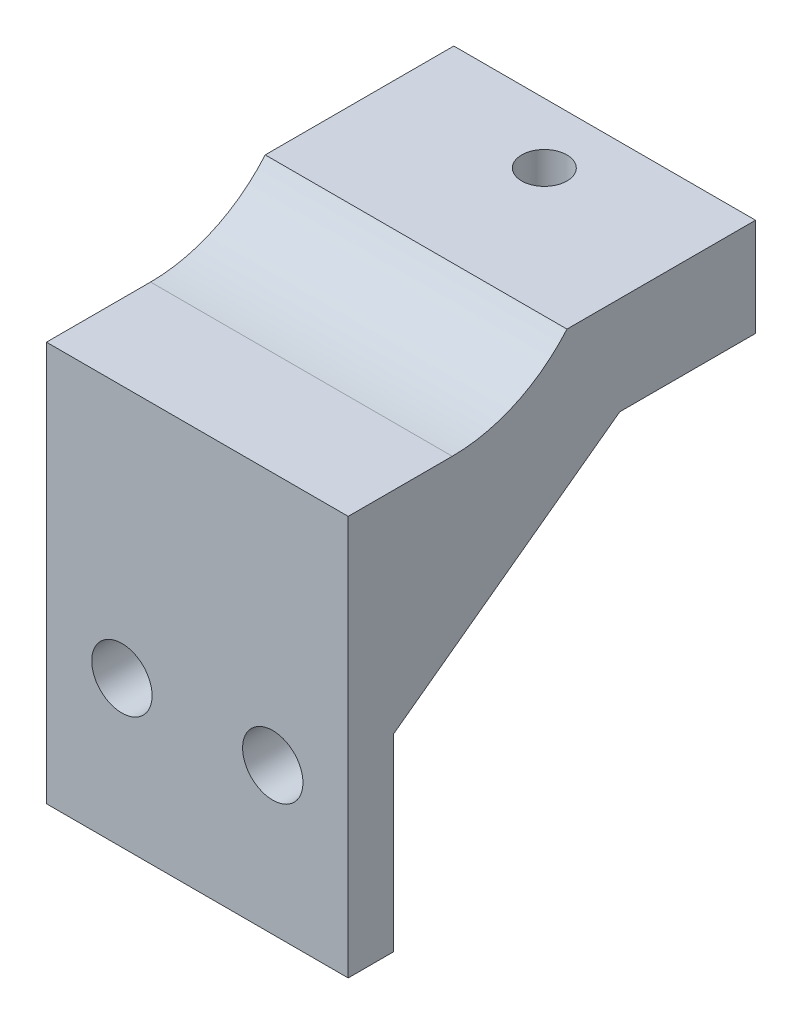
ISO-10303-21;
HEADER;
FILE_DESCRIPTION(('STEP AP214'),'2;1');
FILE_NAME('part.step','',(''),(''),'','','');
FILE_SCHEMA(('AUTOMOTIVE_DESIGN { 1 0 10303 214 1 1 1 1 }'));
ENDSEC;
DATA;
#1=APPLICATION_CONTEXT('core data for automotive mechanical design processes');
#2=APPLICATION_PROTOCOL_DEFINITION('international standard','automotive_design',2000,#1);
#3=PRODUCT_CONTEXT('',#1,'mechanical');
#4=PRODUCT('Part','Part','',(#3));
#5=PRODUCT_RELATED_PRODUCT_CATEGORY('part','',(#4));
#6=PRODUCT_DEFINITION_FORMATION('','',#4);
#7=PRODUCT_DEFINITION_CONTEXT('part definition',#1,'design');
#8=PRODUCT_DEFINITION('design','',#6,#7);
#9=PRODUCT_DEFINITION_SHAPE('','',#8);
#10=(LENGTH_UNIT() NAMED_UNIT(*) SI_UNIT(.MILLI.,.METRE.));
#11=(NAMED_UNIT(*) PLANE_ANGLE_UNIT() SI_UNIT($,.RADIAN.));
#12=(NAMED_UNIT(*) SI_UNIT($,.STERADIAN.) SOLID_ANGLE_UNIT());
#13=UNCERTAINTY_MEASURE_WITH_UNIT(LENGTH_MEASURE(1.E-05),#10,'distance_accuracy_value','');
#14=(GEOMETRIC_REPRESENTATION_CONTEXT(3) GLOBAL_UNCERTAINTY_ASSIGNED_CONTEXT((#13)) GLOBAL_UNIT_ASSIGNED_CONTEXT((#10,
#11,#12)) REPRESENTATION_CONTEXT('',''));
#15=CARTESIAN_POINT('',(0.,0.,0.));
#16=DIRECTION('',(0.,0.,1.));
#17=DIRECTION('',(1.,0.,0.));
#18=AXIS2_PLACEMENT_3D('',#15,#16,#17);
#19=CARTESIAN_POINT('',(0.,0.,0.));
#20=DIRECTION('',(0.,0.,1.));
#21=DIRECTION('',(1.,0.,0.));
#22=AXIS2_PLACEMENT_3D('',#19,#20,#21);
#23=PLANE('',#22);
#24=CARTESIAN_POINT('',(5.,-45.2915026221292,0.));
#25=DIRECTION('',(0.,0.,1.));
#26=DIRECTION('',(1.,0.,0.));
#27=AXIS2_PLACEMENT_3D('',#24,#25,#26);
#28=CIRCLE('',#27,2.);
#29=CARTESIAN_POINT('',(7.,-45.2915026221292,0.));
#30=VERTEX_POINT('',#29);
#31=EDGE_CURVE('E207',#30,#30,#28,.T.);
#32=ORIENTED_EDGE('',*,*,#31,.T.);
#33=EDGE_LOOP('',(#32));
#34=FACE_BOUND('',#33,.T.);
#35=CARTESIAN_POINT('',(15.,-45.2915026221292,0.));
#36=DIRECTION('',(0.,0.,1.));
#37=DIRECTION('',(1.,0.,0.));
#38=AXIS2_PLACEMENT_3D('',#35,#36,#37);
#39=CIRCLE('',#38,2.);
#40=CARTESIAN_POINT('',(17.,-45.2915026221292,0.));
#41=VERTEX_POINT('',#40);
#42=EDGE_CURVE('E184',#41,#41,#39,.T.);
#43=ORIENTED_EDGE('',*,*,#42,.T.);
#44=EDGE_LOOP('',(#43));
#45=FACE_BOUND('',#44,.T.);
#46=DIRECTION('',(0.,-1.,0.));
#47=VECTOR('',#46,1.);
#48=CARTESIAN_POINT('',(18.,-31.5,0.));
#49=LINE('',#48,#47);
#50=CARTESIAN_POINT('',(18.,-31.5,0.));
#51=VERTEX_POINT('',#50);
#52=CARTESIAN_POINT('',(18.,-42.5,0.));
#53=VERTEX_POINT('',#52);
#54=EDGE_CURVE('E157',#51,#53,#49,.T.);
#55=ORIENTED_EDGE('',*,*,#54,.T.);
#56=DIRECTION('',(1.,0.,0.));
#57=VECTOR('',#56,1.);
#58=CARTESIAN_POINT('',(18.,-42.5,0.));
#59=LINE('',#58,#57);
#60=CARTESIAN_POINT('',(20.,-42.5,0.));
#61=VERTEX_POINT('',#60);
#62=EDGE_CURVE('E158',#53,#61,#59,.T.);
#63=ORIENTED_EDGE('',*,*,#62,.T.);
#64=DIRECTION('',(0.,-1.,0.));
#65=VECTOR('',#64,1.);
#66=CARTESIAN_POINT('',(20.,0.,0.));
#67=LINE('',#66,#65);
#68=CARTESIAN_POINT('',(20.,-55.,0.));
#69=VERTEX_POINT('',#68);
#70=EDGE_CURVE('E191',#61,#69,#67,.T.);
#71=ORIENTED_EDGE('',*,*,#70,.T.);
#72=DIRECTION('',(1.,0.,0.));
#73=VECTOR('',#72,1.);
#74=CARTESIAN_POINT('',(0.,-55.,0.));
#75=LINE('',#74,#73);
#76=CARTESIAN_POINT('',(0.,-55.,0.));
#77=VERTEX_POINT('',#76);
#78=EDGE_CURVE('E213',#77,#69,#75,.T.);
#79=ORIENTED_EDGE('',*,*,#78,.F.);
#80=DIRECTION('',(0.,1.,0.));
#81=VECTOR('',#80,1.);
#82=CARTESIAN_POINT('',(0.,0.,0.));
#83=LINE('',#82,#81);
#84=CARTESIAN_POINT('',(0.,-42.5,0.));
#85=VERTEX_POINT('',#84);
#86=EDGE_CURVE('E210',#77,#85,#83,.T.);
#87=ORIENTED_EDGE('',*,*,#86,.T.);
#88=DIRECTION('',(-1.,0.,0.));
#89=VECTOR('',#88,1.);
#90=CARTESIAN_POINT('',(2.,-42.5,0.));
#91=LINE('',#90,#89);
#92=CARTESIAN_POINT('',(2.,-42.5,0.));
#93=VERTEX_POINT('',#92);
#94=EDGE_CURVE('E176',#93,#85,#91,.T.);
#95=ORIENTED_EDGE('',*,*,#94,.F.);
#96=DIRECTION('',(0.,-1.,0.));
#97=VECTOR('',#96,1.);
#98=CARTESIAN_POINT('',(2.,-31.5,0.));
#99=LINE('',#98,#97);
#100=CARTESIAN_POINT('',(2.,-31.5,0.));
#101=VERTEX_POINT('',#100);
#102=EDGE_CURVE('E168',#101,#93,#99,.T.);
#103=ORIENTED_EDGE('',*,*,#102,.F.);
#104=DIRECTION('',(1.,0.,0.));
#105=VECTOR('',#104,1.);
#106=CARTESIAN_POINT('',(20.,-31.5,0.));
#107=LINE('',#106,#105);
#108=EDGE_CURVE('E178',#101,#51,#107,.T.);
#109=ORIENTED_EDGE('',*,*,#108,.T.);
#110=EDGE_LOOP('',(#55,#63,#71,#79,#87,#95,#103,#109));
#111=FACE_BOUND('',#110,.T.);
#112=ADVANCED_FACE('F35',(#34,#45,#111),#23,.F.);
#113=CARTESIAN_POINT('',(20.,-31.5,-24.));
#114=DIRECTION('',(0.,-1.,0.));
#115=DIRECTION('',(0.,0.,-1.));
#116=AXIS2_PLACEMENT_3D('',#113,#114,#115);
#117=PLANE('',#116);
#118=CARTESIAN_POINT('',(10.,-31.5,-20.));
#119=DIRECTION('',(0.,-1.,0.));
#120=DIRECTION('',(0.,0.,-1.));
#121=AXIS2_PLACEMENT_3D('',#118,#119,#120);
#122=CIRCLE('',#121,1.5);
#123=CARTESIAN_POINT('',(10.,-31.5,-18.5));
#124=VERTEX_POINT('',#123);
#125=EDGE_CURVE('E230',#124,#124,#122,.T.);
#126=ORIENTED_EDGE('',*,*,#125,.F.);
#127=EDGE_LOOP('',(#126));
#128=FACE_BOUND('',#127,.T.);
#129=DIRECTION('',(1.,0.,0.));
#130=VECTOR('',#129,1.);
#131=CARTESIAN_POINT('',(18.,-31.5,-15.));
#132=LINE('',#131,#130);
#133=CARTESIAN_POINT('',(18.,-31.5,-15.));
#134=VERTEX_POINT('',#133);
#135=CARTESIAN_POINT('',(20.,-31.5,-15.));
#136=VERTEX_POINT('',#135);
#137=EDGE_CURVE('E162',#134,#136,#132,.T.);
#138=ORIENTED_EDGE('',*,*,#137,.F.);
#139=DIRECTION('',(0.,0.,1.));
#140=VECTOR('',#139,1.);
#141=CARTESIAN_POINT('',(18.,-31.5,-15.));
#142=LINE('',#141,#140);
#143=EDGE_CURVE('E148',#134,#51,#142,.T.);
#144=ORIENTED_EDGE('',*,*,#143,.T.);
#145=ORIENTED_EDGE('',*,*,#108,.F.);
#146=DIRECTION('',(0.,0.,1.));
#147=VECTOR('',#146,1.);
#148=CARTESIAN_POINT('',(2.,-31.5,-15.));
#149=LINE('',#148,#147);
#150=CARTESIAN_POINT('',(2.,-31.5,-15.));
#151=VERTEX_POINT('',#150);
#152=EDGE_CURVE('E166',#151,#101,#149,.T.);
#153=ORIENTED_EDGE('',*,*,#152,.F.);
#154=DIRECTION('',(-1.,0.,0.));
#155=VECTOR('',#154,1.);
#156=CARTESIAN_POINT('',(2.,-31.5,-15.));
#157=LINE('',#156,#155);
#158=CARTESIAN_POINT('',(0.,-31.5,-15.));
#159=VERTEX_POINT('',#158);
#160=EDGE_CURVE('E172',#151,#159,#157,.T.);
#161=ORIENTED_EDGE('',*,*,#160,.T.);
#162=DIRECTION('',(0.,0.,1.));
#163=VECTOR('',#162,1.);
#164=CARTESIAN_POINT('',(0.,-31.5,-24.));
#165=LINE('',#164,#163);
#166=CARTESIAN_POINT('',(0.,-31.5,-24.));
#167=VERTEX_POINT('',#166);
#168=EDGE_CURVE('E131',#167,#159,#165,.T.);
#169=ORIENTED_EDGE('',*,*,#168,.F.);
#170=DIRECTION('',(1.,0.,0.));
#171=VECTOR('',#170,1.);
#172=CARTESIAN_POINT('',(20.,-31.5,-24.));
#173=LINE('',#172,#171);
#174=CARTESIAN_POINT('',(20.,-31.5,-24.));
#175=VERTEX_POINT('',#174);
#176=EDGE_CURVE('E132',#167,#175,#173,.T.);
#177=ORIENTED_EDGE('',*,*,#176,.T.);
#178=DIRECTION('',(0.,0.,1.));
#179=VECTOR('',#178,1.);
#180=CARTESIAN_POINT('',(20.,-31.5,-24.));
#181=LINE('',#180,#179);
#182=EDGE_CURVE('E126',#175,#136,#181,.T.);
#183=ORIENTED_EDGE('',*,*,#182,.T.);
#184=EDGE_LOOP('',(#138,#144,#145,#153,#161,#169,#177,#183));
#185=FACE_BOUND('',#184,.T.);
#186=ADVANCED_FACE('F256',(#128,#185),#117,.T.);
#187=CARTESIAN_POINT('',(0.,0.,3.));
#188=DIRECTION('',(-1.,0.,0.));
#189=DIRECTION('',(0.,0.,1.));
#190=AXIS2_PLACEMENT_3D('',#187,#188,#189);
#191=PLANE('',#190);
#192=DIRECTION('',(0.,0.591363663627517,-0.806404995855706));
#193=VECTOR('',#192,1.);
#194=CARTESIAN_POINT('',(0.,-42.5,0.));
#195=LINE('',#194,#193);
#196=EDGE_CURVE('E165',#85,#159,#195,.T.);
#197=ORIENTED_EDGE('',*,*,#196,.F.);
#198=ORIENTED_EDGE('',*,*,#86,.F.);
#199=DIRECTION('',(0.,0.,-1.));
#200=VECTOR('',#199,1.);
#201=CARTESIAN_POINT('',(0.,-55.,3.));
#202=LINE('',#201,#200);
#203=CARTESIAN_POINT('',(0.,-55.,3.));
#204=VERTEX_POINT('',#203);
#205=EDGE_CURVE('E224',#204,#77,#202,.T.);
#206=ORIENTED_EDGE('',*,*,#205,.F.);
#207=DIRECTION('',(0.,1.,0.));
#208=VECTOR('',#207,1.);
#209=CARTESIAN_POINT('',(0.,0.,3.));
#210=LINE('',#209,#208);
#211=CARTESIAN_POINT('',(0.,-28.5,3.));
#212=VERTEX_POINT('',#211);
#213=EDGE_CURVE('E194',#204,#212,#210,.T.);
#214=ORIENTED_EDGE('',*,*,#213,.T.);
#215=DIRECTION('',(0.,0.,-1.));
#216=VECTOR('',#215,1.);
#217=CARTESIAN_POINT('',(0.,-28.5,3.));
#218=LINE('',#217,#216);
#219=CARTESIAN_POINT('',(0.,-28.5,-3.90065792321466));
#220=VERTEX_POINT('',#219);
#221=EDGE_CURVE('E204',#212,#220,#218,.T.);
#222=ORIENTED_EDGE('',*,*,#221,.T.);
#223=CARTESIAN_POINT('',(0.,-18.5,-3.90065792321466));
#224=DIRECTION('',(-1.,0.,0.));
#225=DIRECTION('',(0.,0.,1.));
#226=AXIS2_PLACEMENT_3D('',#223,#224,#225);
#227=CIRCLE('',#226,10.);
#228=CARTESIAN_POINT('',(0.,-25.,-11.5));
#229=VERTEX_POINT('',#228);
#230=EDGE_CURVE('E43',#220,#229,#227,.F.);
#231=ORIENTED_EDGE('',*,*,#230,.T.);
#232=DIRECTION('',(0.,0.,1.));
#233=VECTOR('',#232,1.);
#234=CARTESIAN_POINT('',(0.,-25.,-11.5));
#235=LINE('',#234,#233);
#236=CARTESIAN_POINT('',(0.,-25.,-24.));
#237=VERTEX_POINT('',#236);
#238=EDGE_CURVE('E140',#237,#229,#235,.T.);
#239=ORIENTED_EDGE('',*,*,#238,.F.);
#240=DIRECTION('',(0.,-1.,0.));
#241=VECTOR('',#240,1.);
#242=CARTESIAN_POINT('',(0.,-31.5,-24.));
#243=LINE('',#242,#241);
#244=EDGE_CURVE('E144',#237,#167,#243,.T.);
#245=ORIENTED_EDGE('',*,*,#244,.T.);
#246=ORIENTED_EDGE('',*,*,#168,.T.);
#247=EDGE_LOOP('',(#197,#198,#206,#214,#222,#231,#239,#245,#246));
#248=FACE_BOUND('',#247,.T.);
#249=ADVANCED_FACE('F233',(#248),#191,.T.);
#250=CARTESIAN_POINT('',(0.,-55.,3.));
#251=DIRECTION('',(0.,1.,0.));
#252=DIRECTION('',(0.,0.,1.));
#253=AXIS2_PLACEMENT_3D('',#250,#251,#252);
#254=PLANE('',#253);
#255=ORIENTED_EDGE('',*,*,#78,.T.);
#256=DIRECTION('',(0.,0.,-1.));
#257=VECTOR('',#256,1.);
#258=CARTESIAN_POINT('',(20.,-55.,3.));
#259=LINE('',#258,#257);
#260=CARTESIAN_POINT('',(20.,-55.,3.));
#261=VERTEX_POINT('',#260);
#262=EDGE_CURVE('E221',#261,#69,#259,.T.);
#263=ORIENTED_EDGE('',*,*,#262,.F.);
#264=DIRECTION('',(1.,0.,0.));
#265=VECTOR('',#264,1.);
#266=CARTESIAN_POINT('',(0.,-55.,3.));
#267=LINE('',#266,#265);
#268=EDGE_CURVE('E197',#204,#261,#267,.T.);
#269=ORIENTED_EDGE('',*,*,#268,.F.);
#270=ORIENTED_EDGE('',*,*,#205,.T.);
#271=EDGE_LOOP('',(#255,#263,#269,#270));
#272=FACE_BOUND('',#271,.T.);
#273=ADVANCED_FACE('F245',(#272),#254,.F.);
#274=CARTESIAN_POINT('',(20.,0.,3.));
#275=DIRECTION('',(1.,0.,0.));
#276=DIRECTION('',(0.,0.,-1.));
#277=AXIS2_PLACEMENT_3D('',#274,#275,#276);
#278=PLANE('',#277);
#279=ORIENTED_EDGE('',*,*,#70,.F.);
#280=DIRECTION('',(0.,0.591363663627517,-0.806404995855706));
#281=VECTOR('',#280,1.);
#282=CARTESIAN_POINT('',(20.,-42.5,0.));
#283=LINE('',#282,#281);
#284=EDGE_CURVE('E146',#61,#136,#283,.T.);
#285=ORIENTED_EDGE('',*,*,#284,.T.);
#286=ORIENTED_EDGE('',*,*,#182,.F.);
#287=DIRECTION('',(0.,1.,0.));
#288=VECTOR('',#287,1.);
#289=CARTESIAN_POINT('',(20.,-28.5,-24.));
#290=LINE('',#289,#288);
#291=CARTESIAN_POINT('',(20.,-25.,-24.));
#292=VERTEX_POINT('',#291);
#293=EDGE_CURVE('E120',#175,#292,#290,.T.);
#294=ORIENTED_EDGE('',*,*,#293,.T.);
#295=DIRECTION('',(0.,0.,1.));
#296=VECTOR('',#295,1.);
#297=CARTESIAN_POINT('',(20.,-25.,-11.5));
#298=LINE('',#297,#296);
#299=CARTESIAN_POINT('',(20.,-25.,-11.5));
#300=VERTEX_POINT('',#299);
#301=EDGE_CURVE('E123',#292,#300,#298,.T.);
#302=ORIENTED_EDGE('',*,*,#301,.T.);
#303=CARTESIAN_POINT('',(20.,-18.5,-3.90065792321466));
#304=DIRECTION('',(1.,0.,0.));
#305=DIRECTION('',(0.,0.,-1.));
#306=AXIS2_PLACEMENT_3D('',#303,#304,#305);
#307=CIRCLE('',#306,10.);
#308=CARTESIAN_POINT('',(20.,-28.5,-3.90065792321466));
#309=VERTEX_POINT('',#308);
#310=EDGE_CURVE('E11',#300,#309,#307,.F.);
#311=ORIENTED_EDGE('',*,*,#310,.T.);
#312=DIRECTION('',(0.,0.,-1.));
#313=VECTOR('',#312,1.);
#314=CARTESIAN_POINT('',(20.,-28.5,3.));
#315=LINE('',#314,#313);
#316=CARTESIAN_POINT('',(20.,-28.5,3.));
#317=VERTEX_POINT('',#316);
#318=EDGE_CURVE('E219',#317,#309,#315,.T.);
#319=ORIENTED_EDGE('',*,*,#318,.F.);
#320=DIRECTION('',(0.,-1.,0.));
#321=VECTOR('',#320,1.);
#322=CARTESIAN_POINT('',(20.,0.,3.));
#323=LINE('',#322,#321);
#324=EDGE_CURVE('E199',#317,#261,#323,.T.);
#325=ORIENTED_EDGE('',*,*,#324,.T.);
#326=ORIENTED_EDGE('',*,*,#262,.T.);
#327=EDGE_LOOP('',(#279,#285,#286,#294,#302,#311,#319,#325,#326));
#328=FACE_BOUND('',#327,.T.);
#329=ADVANCED_FACE('F122',(#328),#278,.T.);
#330=CARTESIAN_POINT('',(5.,-45.2915026221292,3.));
#331=DIRECTION('',(0.,0.,-1.));
#332=DIRECTION('',(-1.,0.,0.));
#333=AXIS2_PLACEMENT_3D('',#330,#331,#332);
#334=CYLINDRICAL_SURFACE('',#333,2.);
#335=CARTESIAN_POINT('',(5.,-45.2915026221292,3.));
#336=DIRECTION('',(0.,0.,1.));
#337=DIRECTION('',(1.,0.,0.));
#338=AXIS2_PLACEMENT_3D('',#335,#336,#337);
#339=CIRCLE('',#338,2.);
#340=CARTESIAN_POINT('',(7.,-45.2915026221292,3.));
#341=VERTEX_POINT('',#340);
#342=EDGE_CURVE('E190',#341,#341,#339,.T.);
#343=ORIENTED_EDGE('',*,*,#342,.T.);
#344=EDGE_LOOP('',(#343));
#345=FACE_BOUND('',#344,.T.);
#346=ORIENTED_EDGE('',*,*,#31,.F.);
#347=EDGE_LOOP('',(#346));
#348=FACE_BOUND('',#347,.T.);
#349=ADVANCED_FACE('F294',(#345,#348),#334,.F.);
#350=CARTESIAN_POINT('',(15.,-45.2915026221292,3.));
#351=DIRECTION('',(0.,0.,-1.));
#352=DIRECTION('',(-1.,0.,0.));
#353=AXIS2_PLACEMENT_3D('',#350,#351,#352);
#354=CYLINDRICAL_SURFACE('',#353,2.);
#355=CARTESIAN_POINT('',(15.,-45.2915026221292,3.));
#356=DIRECTION('',(0.,0.,1.));
#357=DIRECTION('',(1.,0.,0.));
#358=AXIS2_PLACEMENT_3D('',#355,#356,#357);
#359=CIRCLE('',#358,2.);
#360=CARTESIAN_POINT('',(17.,-45.2915026221292,3.));
#361=VERTEX_POINT('',#360);
#362=EDGE_CURVE('E187',#361,#361,#359,.T.);
#363=ORIENTED_EDGE('',*,*,#362,.T.);
#364=EDGE_LOOP('',(#363));
#365=FACE_BOUND('',#364,.T.);
#366=ORIENTED_EDGE('',*,*,#42,.F.);
#367=EDGE_LOOP('',(#366));
#368=FACE_BOUND('',#367,.T.);
#369=ADVANCED_FACE('F291',(#365,#368),#354,.F.);
#370=CARTESIAN_POINT('',(0.,-28.5,3.));
#371=DIRECTION('',(0.,-1.,0.));
#372=DIRECTION('',(0.,0.,-1.));
#373=AXIS2_PLACEMENT_3D('',#370,#371,#372);
#374=PLANE('',#373);
#375=ORIENTED_EDGE('',*,*,#318,.T.);
#376=DIRECTION('',(-1.,0.,0.));
#377=VECTOR('',#376,1.);
#378=CARTESIAN_POINT('',(0.,-28.5,-3.90065792321466));
#379=LINE('',#378,#377);
#380=EDGE_CURVE('E226',#309,#220,#379,.T.);
#381=ORIENTED_EDGE('',*,*,#380,.T.);
#382=ORIENTED_EDGE('',*,*,#221,.F.);
#383=DIRECTION('',(-1.,0.,0.));
#384=VECTOR('',#383,1.);
#385=CARTESIAN_POINT('',(0.,-28.5,3.));
#386=LINE('',#385,#384);
#387=EDGE_CURVE('E202',#317,#212,#386,.T.);
#388=ORIENTED_EDGE('',*,*,#387,.F.);
#389=EDGE_LOOP('',(#375,#381,#382,#388));
#390=FACE_BOUND('',#389,.T.);
#391=ADVANCED_FACE('F236',(#390),#374,.F.);
#392=CARTESIAN_POINT('',(0.,0.,3.));
#393=DIRECTION('',(0.,0.,1.));
#394=DIRECTION('',(1.,0.,0.));
#395=AXIS2_PLACEMENT_3D('',#392,#393,#394);
#396=PLANE('',#395);
#397=ORIENTED_EDGE('',*,*,#362,.F.);
#398=EDGE_LOOP('',(#397));
#399=FACE_BOUND('',#398,.T.);
#400=ORIENTED_EDGE('',*,*,#342,.F.);
#401=EDGE_LOOP('',(#400));
#402=FACE_BOUND('',#401,.T.);
#403=ORIENTED_EDGE('',*,*,#213,.F.);
#404=ORIENTED_EDGE('',*,*,#268,.T.);
#405=ORIENTED_EDGE('',*,*,#324,.F.);
#406=ORIENTED_EDGE('',*,*,#387,.T.);
#407=EDGE_LOOP('',(#403,#404,#405,#406));
#408=FACE_BOUND('',#407,.T.);
#409=ADVANCED_FACE('F242',(#399,#402,#408),#396,.T.);
#410=CARTESIAN_POINT('',(0.,0.,-24.));
#411=DIRECTION('',(0.,0.,-1.));
#412=DIRECTION('',(-1.,0.,0.));
#413=AXIS2_PLACEMENT_3D('',#410,#411,#412);
#414=PLANE('',#413);
#415=ORIENTED_EDGE('',*,*,#244,.F.);
#416=DIRECTION('',(-1.,0.,0.));
#417=VECTOR('',#416,1.);
#418=CARTESIAN_POINT('',(20.,-25.,-24.));
#419=LINE('',#418,#417);
#420=EDGE_CURVE('E138',#292,#237,#419,.T.);
#421=ORIENTED_EDGE('',*,*,#420,.F.);
#422=ORIENTED_EDGE('',*,*,#293,.F.);
#423=ORIENTED_EDGE('',*,*,#176,.F.);
#424=EDGE_LOOP('',(#415,#421,#422,#423));
#425=FACE_BOUND('',#424,.T.);
#426=ADVANCED_FACE('F142',(#425),#414,.T.);
#427=CARTESIAN_POINT('',(2.,-42.5,0.));
#428=DIRECTION('',(0.,0.806404995855706,0.591363663627517));
#429=DIRECTION('',(0.,-0.591363663627517,0.806404995855706));
#430=AXIS2_PLACEMENT_3D('',#427,#428,#429);
#431=PLANE('',#430);
#432=ORIENTED_EDGE('',*,*,#196,.T.);
#433=ORIENTED_EDGE('',*,*,#160,.F.);
#434=DIRECTION('',(0.,0.591363663627517,-0.806404995855706));
#435=VECTOR('',#434,1.);
#436=CARTESIAN_POINT('',(2.,-42.5,0.));
#437=LINE('',#436,#435);
#438=EDGE_CURVE('E170',#93,#151,#437,.T.);
#439=ORIENTED_EDGE('',*,*,#438,.F.);
#440=ORIENTED_EDGE('',*,*,#94,.T.);
#441=EDGE_LOOP('',(#432,#433,#439,#440));
#442=FACE_BOUND('',#441,.T.);
#443=ADVANCED_FACE('F252',(#442),#431,.F.);
#444=CARTESIAN_POINT('',(2.,0.,0.));
#445=DIRECTION('',(1.,0.,0.));
#446=DIRECTION('',(0.,0.,-1.));
#447=AXIS2_PLACEMENT_3D('',#444,#445,#446);
#448=PLANE('',#447);
#449=ORIENTED_EDGE('',*,*,#152,.T.);
#450=ORIENTED_EDGE('',*,*,#102,.T.);
#451=ORIENTED_EDGE('',*,*,#438,.T.);
#452=EDGE_LOOP('',(#449,#450,#451));
#453=FACE_BOUND('',#452,.T.);
#454=ADVANCED_FACE('F260',(#453),#448,.T.);
#455=CARTESIAN_POINT('',(18.,-42.5,0.));
#456=DIRECTION('',(0.,-0.806404995855706,-0.591363663627517));
#457=DIRECTION('',(0.,0.591363663627517,-0.806404995855706));
#458=AXIS2_PLACEMENT_3D('',#455,#456,#457);
#459=PLANE('',#458);
#460=ORIENTED_EDGE('',*,*,#284,.F.);
#461=ORIENTED_EDGE('',*,*,#62,.F.);
#462=DIRECTION('',(0.,0.591363663627517,-0.806404995855706));
#463=VECTOR('',#462,1.);
#464=CARTESIAN_POINT('',(18.,-42.5,0.));
#465=LINE('',#464,#463);
#466=EDGE_CURVE('E154',#53,#134,#465,.T.);
#467=ORIENTED_EDGE('',*,*,#466,.T.);
#468=ORIENTED_EDGE('',*,*,#137,.T.);
#469=EDGE_LOOP('',(#460,#461,#467,#468));
#470=FACE_BOUND('',#469,.T.);
#471=ADVANCED_FACE('F269',(#470),#459,.T.);
#472=CARTESIAN_POINT('',(18.,0.,0.));
#473=DIRECTION('',(-1.,0.,0.));
#474=DIRECTION('',(0.,0.,-1.));
#475=AXIS2_PLACEMENT_3D('',#472,#473,#474);
#476=PLANE('',#475);
#477=ORIENTED_EDGE('',*,*,#143,.F.);
#478=ORIENTED_EDGE('',*,*,#466,.F.);
#479=ORIENTED_EDGE('',*,*,#54,.F.);
#480=EDGE_LOOP('',(#477,#478,#479));
#481=FACE_BOUND('',#480,.T.);
#482=ADVANCED_FACE('F266',(#481),#476,.T.);
#483=CARTESIAN_POINT('',(20.,-25.,-11.5));
#484=DIRECTION('',(0.,-1.,0.));
#485=DIRECTION('',(0.,0.,-1.));
#486=AXIS2_PLACEMENT_3D('',#483,#484,#485);
#487=PLANE('',#486);
#488=CARTESIAN_POINT('',(10.,-25.,-20.));
#489=DIRECTION('',(0.,-1.,0.));
#490=DIRECTION('',(0.,0.,-1.));
#491=AXIS2_PLACEMENT_3D('',#488,#489,#490);
#492=CIRCLE('',#491,1.5);
#493=CARTESIAN_POINT('',(10.,-25.,-18.5));
#494=VERTEX_POINT('',#493);
#495=EDGE_CURVE('E227',#494,#494,#492,.T.);
#496=ORIENTED_EDGE('',*,*,#495,.T.);
#497=EDGE_LOOP('',(#496));
#498=FACE_BOUND('',#497,.T.);
#499=ORIENTED_EDGE('',*,*,#238,.T.);
#500=DIRECTION('',(-1.,0.,0.));
#501=VECTOR('',#500,1.);
#502=CARTESIAN_POINT('',(20.,-25.,-11.5));
#503=LINE('',#502,#501);
#504=EDGE_CURVE('E139',#300,#229,#503,.T.);
#505=ORIENTED_EDGE('',*,*,#504,.F.);
#506=ORIENTED_EDGE('',*,*,#301,.F.);
#507=ORIENTED_EDGE('',*,*,#420,.T.);
#508=EDGE_LOOP('',(#499,#505,#506,#507));
#509=FACE_BOUND('',#508,.T.);
#510=ADVANCED_FACE('F137',(#498,#509),#487,.F.);
#511=CARTESIAN_POINT('',(10.,-38.5,-20.));
#512=DIRECTION('',(0.,1.,0.));
#513=DIRECTION('',(0.,0.,1.));
#514=AXIS2_PLACEMENT_3D('',#511,#512,#513);
#515=CYLINDRICAL_SURFACE('',#514,1.5);
#516=CARTESIAN_POINT('',(10.,-31.5,-18.5));
#517=CARTESIAN_POINT('',(10.,-31.4322916666667,-18.5));
#518=CARTESIAN_POINT('',(10.,-31.3645833333333,-18.5));
#519=CARTESIAN_POINT('',(10.,-31.2291666666667,-18.5));
#520=CARTESIAN_POINT('',(10.,-31.1614583333333,-18.5));
#521=CARTESIAN_POINT('',(10.,-31.0260416666667,-18.5));
#522=CARTESIAN_POINT('',(10.,-30.9583333333333,-18.5));
#523=CARTESIAN_POINT('',(10.,-30.8229166666667,-18.5));
#524=CARTESIAN_POINT('',(10.,-30.7552083333333,-18.5));
#525=CARTESIAN_POINT('',(10.,-30.6197916666667,-18.5));
#526=CARTESIAN_POINT('',(10.,-30.5520833333333,-18.5));
#527=CARTESIAN_POINT('',(10.,-30.4166666666667,-18.5));
#528=CARTESIAN_POINT('',(10.,-30.3489583333333,-18.5));
#529=CARTESIAN_POINT('',(10.,-30.2135416666667,-18.5));
#530=CARTESIAN_POINT('',(10.,-30.1458333333333,-18.5));
#531=CARTESIAN_POINT('',(10.,-30.0104166666667,-18.5));
#532=CARTESIAN_POINT('',(10.,-29.9427083333333,-18.5));
#533=CARTESIAN_POINT('',(10.,-29.8072916666667,-18.5));
#534=CARTESIAN_POINT('',(10.,-29.7395833333333,-18.5));
#535=CARTESIAN_POINT('',(10.,-29.6041666666667,-18.5));
#536=CARTESIAN_POINT('',(10.,-29.5364583333333,-18.5));
#537=CARTESIAN_POINT('',(10.,-29.4010416666667,-18.5));
#538=CARTESIAN_POINT('',(10.,-29.3333333333333,-18.5));
#539=CARTESIAN_POINT('',(10.,-29.1979166666667,-18.5));
#540=CARTESIAN_POINT('',(10.,-29.1302083333333,-18.5));
#541=CARTESIAN_POINT('',(10.,-28.9947916666667,-18.5));
#542=CARTESIAN_POINT('',(10.,-28.9270833333333,-18.5));
#543=CARTESIAN_POINT('',(10.,-28.7916666666667,-18.5));
#544=CARTESIAN_POINT('',(10.,-28.7239583333333,-18.5));
#545=CARTESIAN_POINT('',(10.,-28.5885416666667,-18.5));
#546=CARTESIAN_POINT('',(10.,-28.5208333333333,-18.5));
#547=CARTESIAN_POINT('',(10.,-28.3854166666667,-18.5));
#548=CARTESIAN_POINT('',(10.,-28.3177083333333,-18.5));
#549=CARTESIAN_POINT('',(10.,-28.1822916666667,-18.5));
#550=CARTESIAN_POINT('',(10.,-28.1145833333333,-18.5));
#551=CARTESIAN_POINT('',(10.,-27.9791666666667,-18.5));
#552=CARTESIAN_POINT('',(10.,-27.9114583333333,-18.5));
#553=CARTESIAN_POINT('',(10.,-27.7760416666667,-18.5));
#554=CARTESIAN_POINT('',(10.,-27.7083333333333,-18.5));
#555=CARTESIAN_POINT('',(10.,-27.5729166666667,-18.5));
#556=CARTESIAN_POINT('',(10.,-27.5052083333333,-18.5));
#557=CARTESIAN_POINT('',(10.,-27.3697916666667,-18.5));
#558=CARTESIAN_POINT('',(10.,-27.3020833333333,-18.5));
#559=CARTESIAN_POINT('',(10.,-27.1666666666667,-18.5));
#560=CARTESIAN_POINT('',(10.,-27.0989583333333,-18.5));
#561=CARTESIAN_POINT('',(10.,-26.9635416666667,-18.5));
#562=CARTESIAN_POINT('',(10.,-26.8958333333333,-18.5));
#563=CARTESIAN_POINT('',(10.,-26.7604166666667,-18.5));
#564=CARTESIAN_POINT('',(10.,-26.6927083333333,-18.5));
#565=CARTESIAN_POINT('',(10.,-26.5572916666667,-18.5));
#566=CARTESIAN_POINT('',(10.,-26.4895833333333,-18.5));
#567=CARTESIAN_POINT('',(10.,-26.3541666666667,-18.5));
#568=CARTESIAN_POINT('',(10.,-26.2864583333333,-18.5));
#569=CARTESIAN_POINT('',(10.,-26.1510416666667,-18.5));
#570=CARTESIAN_POINT('',(10.,-26.0833333333333,-18.5));
#571=CARTESIAN_POINT('',(10.,-25.9479166666667,-18.5));
#572=CARTESIAN_POINT('',(10.,-25.8802083333333,-18.5));
#573=CARTESIAN_POINT('',(10.,-25.7447916666667,-18.5));
#574=CARTESIAN_POINT('',(10.,-25.6770833333333,-18.5));
#575=CARTESIAN_POINT('',(10.,-25.5416666666667,-18.5));
#576=CARTESIAN_POINT('',(10.,-25.4739583333333,-18.5));
#577=CARTESIAN_POINT('',(10.,-25.3385416666667,-18.5));
#578=CARTESIAN_POINT('',(10.,-25.2708333333333,-18.5));
#579=CARTESIAN_POINT('',(10.,-25.1354166666667,-18.5));
#580=CARTESIAN_POINT('',(10.,-25.0677083333333,-18.5));
#581=CARTESIAN_POINT('',(10.,-25.,-18.5));
#582=B_SPLINE_CURVE_WITH_KNOTS('',3,(#516,#517,#518,#519,#520,#521,#522,#523,#524,#525,#526,
#527,#528,#529,#530,#531,#532,#533,#534,#535,#536,#537,#538,#539,#540,#541,#542,#543,#544,#545,
#546,#547,#548,#549,#550,#551,#552,#553,#554,#555,#556,#557,#558,#559,#560,#561,#562,#563,#564,
#565,#566,#567,#568,#569,#570,#571,#572,#573,#574,#575,#576,#577,#578,#579,#580,#581),
.UNSPECIFIED.,.F.,.F.,(4,2,2,2,2,2,2,2,2,2,2,2,2,2,2,2,2,2,2,2,2,2,2,2,2,2,2,2,2,2,2,2,4),(0.,
0.203124999999998,0.406249999999997,0.609374999999995,0.812499999999994,1.015625,1.21875,
1.421875,1.62499999999999,1.828125,2.03125,2.234375,2.4375,2.64062499999999,2.84375,3.046875,
3.25,3.45312499999999,3.65624999999999,3.85937499999999,4.0625,4.26562499999999,
4.46874999999999,4.67187499999999,4.87499999999999,5.078125,5.28124999999999,5.48437499999999,
5.68749999999999,5.890625,6.09374999999999,6.29687499999999,6.49999999999999),.UNSPECIFIED.);
#583=EDGE_CURVE('BSEAM364',#124,#494,#582,.T.);
#584=ORIENTED_EDGE('',*,*,#125,.T.);
#585=ORIENTED_EDGE('',*,*,#495,.F.);
#586=ORIENTED_EDGE('',*,*,#583,.T.);
#587=ORIENTED_EDGE('',*,*,#583,.F.);
#588=EDGE_LOOP('',(#584,#586,#585,#587));
#589=FACE_BOUND('',#588,.T.);
#590=ADVANCED_FACE('F364',(#589),#515,.F.);
#591=CARTESIAN_POINT('',(20.,-18.5,-3.90065792321466));
#592=DIRECTION('',(-1.,0.,0.));
#593=DIRECTION('',(0.,0.,1.));
#594=AXIS2_PLACEMENT_3D('',#591,#592,#593);
#595=CYLINDRICAL_SURFACE('',#594,10.);
#596=ORIENTED_EDGE('',*,*,#310,.F.);
#597=ORIENTED_EDGE('',*,*,#504,.T.);
#598=ORIENTED_EDGE('',*,*,#230,.F.);
#599=ORIENTED_EDGE('',*,*,#380,.F.);
#600=EDGE_LOOP('',(#596,#597,#598,#599));
#601=FACE_BOUND('',#600,.T.);
#602=ADVANCED_FACE('F37',(#601),#595,.F.);
#603=CLOSED_SHELL('',(#112,#186,#249,#273,#329,#349,#369,#391,#409,#426,#443,#454,#471,#482,
#510,#590,#602));
#604=MANIFOLD_SOLID_BREP('B2',#603);
#605=ADVANCED_BREP_SHAPE_REPRESENTATION('',(#18,#604),#14);
#606=SHAPE_DEFINITION_REPRESENTATION(#9,#605);
ENDSEC;
END-ISO-10303-21;
